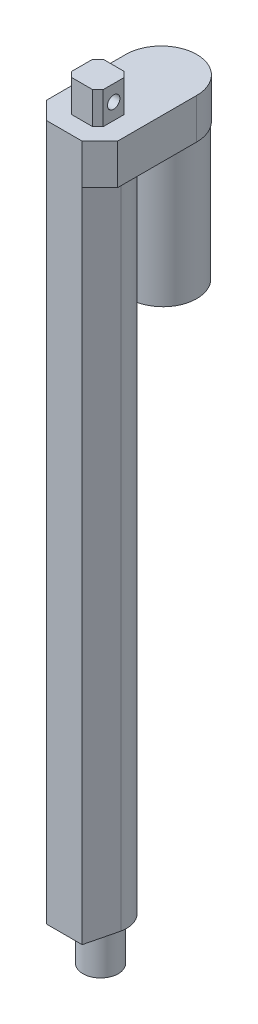
ISO-10303-21;
HEADER;
FILE_DESCRIPTION(('STEP AP214'),'2;1');
FILE_NAME('part.step','',(''),(''),'','','');
FILE_SCHEMA(('AUTOMOTIVE_DESIGN { 1 0 10303 214 1 1 1 1 }'));
ENDSEC;
DATA;
#1=APPLICATION_CONTEXT('core data for automotive mechanical design processes');
#2=APPLICATION_PROTOCOL_DEFINITION('international standard','automotive_design',2000,#1);
#3=PRODUCT_CONTEXT('',#1,'mechanical');
#4=PRODUCT('Part','Part','',(#3));
#5=PRODUCT_RELATED_PRODUCT_CATEGORY('part','',(#4));
#6=PRODUCT_DEFINITION_FORMATION('','',#4);
#7=PRODUCT_DEFINITION_CONTEXT('part definition',#1,'design');
#8=PRODUCT_DEFINITION('design','',#6,#7);
#9=PRODUCT_DEFINITION_SHAPE('','',#8);
#10=(LENGTH_UNIT() NAMED_UNIT(*) SI_UNIT(.MILLI.,.METRE.));
#11=(NAMED_UNIT(*) PLANE_ANGLE_UNIT() SI_UNIT($,.RADIAN.));
#12=(NAMED_UNIT(*) SI_UNIT($,.STERADIAN.) SOLID_ANGLE_UNIT());
#13=UNCERTAINTY_MEASURE_WITH_UNIT(LENGTH_MEASURE(1.E-05),#10,'distance_accuracy_value','');
#14=(GEOMETRIC_REPRESENTATION_CONTEXT(3) GLOBAL_UNCERTAINTY_ASSIGNED_CONTEXT((#13)) GLOBAL_UNIT_ASSIGNED_CONTEXT((#10,
#11,#12)) REPRESENTATION_CONTEXT('',''));
#15=CARTESIAN_POINT('',(0.,0.,0.));
#16=DIRECTION('',(0.,0.,1.));
#17=DIRECTION('',(1.,0.,0.));
#18=AXIS2_PLACEMENT_3D('',#15,#16,#17);
#19=CARTESIAN_POINT('',(0.,392.303,-34.2075));
#20=DIRECTION('',(0.,-1.,0.));
#21=DIRECTION('',(0.,0.,-1.));
#22=AXIS2_PLACEMENT_3D('',#19,#20,#21);
#23=PLANE('',#22);
#24=DIRECTION('',(0.,0.,1.));
#25=VECTOR('',#24,1.);
#26=CARTESIAN_POINT('',(-20.,392.303,20.405));
#27=LINE('',#26,#25);
#28=CARTESIAN_POINT('',(-20.,392.303,-34.2075));
#29=VERTEX_POINT('',#28);
#30=CARTESIAN_POINT('',(-20.,392.303,10.405));
#31=VERTEX_POINT('',#30);
#32=EDGE_CURVE('E220',#29,#31,#27,.T.);
#33=ORIENTED_EDGE('',*,*,#32,.T.);
#34=DIRECTION('',(-0.707106781186548,0.,-0.707106781186547));
#35=VECTOR('',#34,1.);
#36=CARTESIAN_POINT('',(-9.99999999999999,392.303,20.405));
#37=LINE('',#36,#35);
#38=CARTESIAN_POINT('',(-9.99999999999999,392.303,20.405));
#39=VERTEX_POINT('',#38);
#40=EDGE_CURVE('E288',#31,#39,#37,.F.);
#41=ORIENTED_EDGE('',*,*,#40,.T.);
#42=DIRECTION('',(1.,0.,0.));
#43=VECTOR('',#42,1.);
#44=CARTESIAN_POINT('',(-20.,392.303,20.405));
#45=LINE('',#44,#43);
#46=CARTESIAN_POINT('',(9.99999999999999,392.303,20.405));
#47=VERTEX_POINT('',#46);
#48=EDGE_CURVE('E187',#39,#47,#45,.T.);
#49=ORIENTED_EDGE('',*,*,#48,.T.);
#50=DIRECTION('',(-0.707106781186548,0.,0.707106781186548));
#51=VECTOR('',#50,1.);
#52=CARTESIAN_POINT('',(20.,392.303,10.405));
#53=LINE('',#52,#51);
#54=CARTESIAN_POINT('',(20.,392.303,10.405));
#55=VERTEX_POINT('',#54);
#56=EDGE_CURVE('E182',#47,#55,#53,.F.);
#57=ORIENTED_EDGE('',*,*,#56,.T.);
#58=DIRECTION('',(0.,0.,-1.));
#59=VECTOR('',#58,1.);
#60=CARTESIAN_POINT('',(20.,392.303,20.405));
#61=LINE('',#60,#59);
#62=CARTESIAN_POINT('',(20.,392.303,-34.2075));
#63=VERTEX_POINT('',#62);
#64=EDGE_CURVE('E174',#55,#63,#61,.T.);
#65=ORIENTED_EDGE('',*,*,#64,.T.);
#66=CARTESIAN_POINT('',(0.,392.303,-34.2075));
#67=DIRECTION('',(0.,1.,0.));
#68=DIRECTION('',(0.,0.,-1.));
#69=AXIS2_PLACEMENT_3D('',#66,#67,#68);
#70=CIRCLE('',#69,20.);
#71=EDGE_CURVE('E178',#63,#29,#70,.T.);
#72=ORIENTED_EDGE('',*,*,#71,.T.);
#73=EDGE_LOOP('',(#33,#41,#49,#57,#65,#72));
#74=FACE_BOUND('',#73,.T.);
#75=DIRECTION('',(0.,0.,1.));
#76=VECTOR('',#75,1.);
#77=CARTESIAN_POINT('',(-8.89,392.303,10.405));
#78=LINE('',#77,#76);
#79=CARTESIAN_POINT('',(-8.89,392.303,-4.37499999999999));
#80=VERTEX_POINT('',#79);
#81=CARTESIAN_POINT('',(-8.89,392.303,7.405));
#82=VERTEX_POINT('',#81);
#83=EDGE_CURVE('E299',#80,#82,#78,.T.);
#84=ORIENTED_EDGE('',*,*,#83,.F.);
#85=DIRECTION('',(-0.707106781186547,0.,0.707106781186548));
#86=VECTOR('',#85,1.);
#87=CARTESIAN_POINT('',(10.47125,392.303,-23.73625));
#88=LINE('',#87,#86);
#89=CARTESIAN_POINT('',(-5.89,392.303,-7.37499999999999));
#90=VERTEX_POINT('',#89);
#91=EDGE_CURVE('E62',#80,#90,#88,.F.);
#92=ORIENTED_EDGE('',*,*,#91,.T.);
#93=DIRECTION('',(-1.,0.,0.));
#94=VECTOR('',#93,1.);
#95=CARTESIAN_POINT('',(-8.89,392.303,-7.37499999999999));
#96=LINE('',#95,#94);
#97=CARTESIAN_POINT('',(5.89000000000005,392.303,-7.37499999999999));
#98=VERTEX_POINT('',#97);
#99=EDGE_CURVE('E390',#98,#90,#96,.T.);
#100=ORIENTED_EDGE('',*,*,#99,.F.);
#101=DIRECTION('',(-0.707106781186548,0.,-0.707106781186548));
#102=VECTOR('',#101,1.);
#103=CARTESIAN_POINT('',(-10.47125,392.303,-23.73625));
#104=LINE('',#103,#102);
#105=CARTESIAN_POINT('',(8.89,392.303,-4.37500000000004));
#106=VERTEX_POINT('',#105);
#107=EDGE_CURVE('E11',#98,#106,#104,.F.);
#108=ORIENTED_EDGE('',*,*,#107,.T.);
#109=DIRECTION('',(0.,0.,-1.));
#110=VECTOR('',#109,1.);
#111=CARTESIAN_POINT('',(8.89,392.303,10.405));
#112=LINE('',#111,#110);
#113=CARTESIAN_POINT('',(8.89,392.303,7.405));
#114=VERTEX_POINT('',#113);
#115=EDGE_CURVE('E350',#114,#106,#112,.T.);
#116=ORIENTED_EDGE('',*,*,#115,.F.);
#117=DIRECTION('',(0.707106781186548,0.,-0.707106781186547));
#118=VECTOR('',#117,1.);
#119=CARTESIAN_POINT('',(25.25125,392.303,-8.95625));
#120=LINE('',#119,#118);
#121=CARTESIAN_POINT('',(5.88999999999999,392.303,10.405));
#122=VERTEX_POINT('',#121);
#123=EDGE_CURVE('E342',#114,#122,#120,.F.);
#124=ORIENTED_EDGE('',*,*,#123,.T.);
#125=DIRECTION('',(1.,0.,0.));
#126=VECTOR('',#125,1.);
#127=CARTESIAN_POINT('',(-8.89,392.303,10.405));
#128=LINE('',#127,#126);
#129=CARTESIAN_POINT('',(-5.89,392.303,10.405));
#130=VERTEX_POINT('',#129);
#131=EDGE_CURVE('E348',#130,#122,#128,.T.);
#132=ORIENTED_EDGE('',*,*,#131,.F.);
#133=DIRECTION('',(0.707106781186548,0.,0.707106781186548));
#134=VECTOR('',#133,1.);
#135=CARTESIAN_POINT('',(-25.25125,392.303,-8.95625000000001));
#136=LINE('',#135,#134);
#137=EDGE_CURVE('E339',#130,#82,#136,.F.);
#138=ORIENTED_EDGE('',*,*,#137,.T.);
#139=EDGE_LOOP('',(#84,#92,#100,#108,#116,#124,#132,#138));
#140=FACE_BOUND('',#139,.T.);
#141=ADVANCED_FACE('F52',(#74,#140),#23,.F.);
#142=CARTESIAN_POINT('',(0.,369.57,0.));
#143=DIRECTION('',(0.,-1.,0.));
#144=DIRECTION('',(0.,0.,-1.));
#145=AXIS2_PLACEMENT_3D('',#142,#143,#144);
#146=CYLINDRICAL_SURFACE('',#145,14.595);
#147=CARTESIAN_POINT('',(0.,0.,0.));
#148=DIRECTION('',(0.,1.,0.));
#149=DIRECTION('',(0.,0.,1.));
#150=AXIS2_PLACEMENT_3D('',#147,#148,#149);
#151=CIRCLE('',#150,14.595);
#152=CARTESIAN_POINT('',(14.2987228957516,0.,2.92584151151603));
#153=VERTEX_POINT('',#152);
#154=CARTESIAN_POINT('',(-14.2987228957516,0.,2.92584151151603));
#155=VERTEX_POINT('',#154);
#156=EDGE_CURVE('E225',#153,#155,#151,.T.);
#157=ORIENTED_EDGE('',*,*,#156,.T.);
#158=DIRECTION('',(0.,-1.,0.));
#159=VECTOR('',#158,1.);
#160=CARTESIAN_POINT('',(-14.2987228957516,369.57,2.92584151151603));
#161=LINE('',#160,#159);
#162=CARTESIAN_POINT('',(-14.2987228957516,369.57,2.92584151151603));
#163=VERTEX_POINT('',#162);
#164=EDGE_CURVE('E231',#163,#155,#161,.T.);
#165=ORIENTED_EDGE('',*,*,#164,.F.);
#166=CARTESIAN_POINT('',(0.,369.57,0.));
#167=DIRECTION('',(0.,1.,0.));
#168=DIRECTION('',(0.,0.,1.));
#169=AXIS2_PLACEMENT_3D('',#166,#167,#168);
#170=CIRCLE('',#169,14.595);
#171=CARTESIAN_POINT('',(14.2987228957516,369.57,2.92584151151603));
#172=VERTEX_POINT('',#171);
#173=EDGE_CURVE('E232',#172,#163,#170,.T.);
#174=ORIENTED_EDGE('',*,*,#173,.F.);
#175=DIRECTION('',(0.,-1.,0.));
#176=VECTOR('',#175,1.);
#177=CARTESIAN_POINT('',(14.2987228957516,369.57,2.92584151151603));
#178=LINE('',#177,#176);
#179=EDGE_CURVE('E245',#172,#153,#178,.T.);
#180=ORIENTED_EDGE('',*,*,#179,.T.);
#181=EDGE_LOOP('',(#157,#165,#174,#180));
#182=FACE_BOUND('',#181,.T.);
#183=ADVANCED_FACE('F434',(#182),#146,.T.);
#184=CARTESIAN_POINT('',(-10.,369.57,20.405));
#185=DIRECTION('',(0.971064360471332,0.,-0.238817938652864));
#186=DIRECTION('',(-0.238817938652864,0.,-0.971064360471332));
#187=AXIS2_PLACEMENT_3D('',#184,#185,#186);
#188=PLANE('',#187);
#189=DIRECTION('',(0.238817938652864,0.,0.971064360471332));
#190=VECTOR('',#189,1.);
#191=CARTESIAN_POINT('',(-10.,0.,20.405));
#192=LINE('',#191,#190);
#193=CARTESIAN_POINT('',(-10.,0.,20.405));
#194=VERTEX_POINT('',#193);
#195=EDGE_CURVE('E249',#155,#194,#192,.T.);
#196=ORIENTED_EDGE('',*,*,#195,.T.);
#197=DIRECTION('',(0.,-1.,0.));
#198=VECTOR('',#197,1.);
#199=CARTESIAN_POINT('',(-10.,369.57,20.405));
#200=LINE('',#199,#198);
#201=CARTESIAN_POINT('',(-10.,369.57,20.405));
#202=VERTEX_POINT('',#201);
#203=EDGE_CURVE('E264',#202,#194,#200,.T.);
#204=ORIENTED_EDGE('',*,*,#203,.F.);
#205=DIRECTION('',(0.238817938652864,0.,0.971064360471332));
#206=VECTOR('',#205,1.);
#207=CARTESIAN_POINT('',(-10.,369.57,20.405));
#208=LINE('',#207,#206);
#209=EDGE_CURVE('E236',#163,#202,#208,.T.);
#210=ORIENTED_EDGE('',*,*,#209,.F.);
#211=ORIENTED_EDGE('',*,*,#164,.T.);
#212=EDGE_LOOP('',(#196,#204,#210,#211));
#213=FACE_BOUND('',#212,.T.);
#214=ADVANCED_FACE('F423',(#213),#188,.F.);
#215=CARTESIAN_POINT('',(10.,369.57,20.405));
#216=DIRECTION('',(0.,0.,-1.));
#217=DIRECTION('',(-1.,0.,0.));
#218=AXIS2_PLACEMENT_3D('',#215,#216,#217);
#219=PLANE('',#218);
#220=ORIENTED_EDGE('',*,*,#48,.F.);
#221=DIRECTION('',(0.,-1.,0.));
#222=VECTOR('',#221,1.);
#223=CARTESIAN_POINT('',(-9.99999999999999,369.57,20.405));
#224=LINE('',#223,#222);
#225=EDGE_CURVE('E273',#39,#202,#224,.T.);
#226=ORIENTED_EDGE('',*,*,#225,.T.);
#227=ORIENTED_EDGE('',*,*,#203,.T.);
#228=DIRECTION('',(1.,0.,0.));
#229=VECTOR('',#228,1.);
#230=CARTESIAN_POINT('',(10.,0.,20.405));
#231=LINE('',#230,#229);
#232=CARTESIAN_POINT('',(10.,0.,20.405));
#233=VERTEX_POINT('',#232);
#234=EDGE_CURVE('E252',#194,#233,#231,.T.);
#235=ORIENTED_EDGE('',*,*,#234,.T.);
#236=DIRECTION('',(0.,-1.,0.));
#237=VECTOR('',#236,1.);
#238=CARTESIAN_POINT('',(10.,369.57,20.405));
#239=LINE('',#238,#237);
#240=CARTESIAN_POINT('',(10.,369.57,20.405));
#241=VERTEX_POINT('',#240);
#242=EDGE_CURVE('E260',#241,#233,#239,.T.);
#243=ORIENTED_EDGE('',*,*,#242,.F.);
#244=DIRECTION('',(0.,1.,0.));
#245=VECTOR('',#244,1.);
#246=CARTESIAN_POINT('',(9.99999999999999,369.57,20.405));
#247=LINE('',#246,#245);
#248=EDGE_CURVE('E230',#241,#47,#247,.T.);
#249=ORIENTED_EDGE('',*,*,#248,.T.);
#250=EDGE_LOOP('',(#220,#226,#227,#235,#243,#249));
#251=FACE_BOUND('',#250,.T.);
#252=ADVANCED_FACE('F420',(#251),#219,.F.);
#253=CARTESIAN_POINT('',(14.2987228957516,369.57,2.92584151151603));
#254=DIRECTION('',(-0.971064360471332,0.,-0.238817938652864));
#255=DIRECTION('',(-0.238817938652864,0.,0.971064360471332));
#256=AXIS2_PLACEMENT_3D('',#253,#254,#255);
#257=PLANE('',#256);
#258=DIRECTION('',(0.238817938652864,0.,-0.971064360471332));
#259=VECTOR('',#258,1.);
#260=CARTESIAN_POINT('',(14.2987228957516,0.,2.92584151151603));
#261=LINE('',#260,#259);
#262=EDGE_CURVE('E237',#233,#153,#261,.T.);
#263=ORIENTED_EDGE('',*,*,#262,.T.);
#264=ORIENTED_EDGE('',*,*,#179,.F.);
#265=DIRECTION('',(0.238817938652864,0.,-0.971064360471332));
#266=VECTOR('',#265,1.);
#267=CARTESIAN_POINT('',(14.2987228957516,369.57,2.92584151151603));
#268=LINE('',#267,#266);
#269=EDGE_CURVE('E241',#241,#172,#268,.T.);
#270=ORIENTED_EDGE('',*,*,#269,.F.);
#271=ORIENTED_EDGE('',*,*,#242,.T.);
#272=EDGE_LOOP('',(#263,#264,#270,#271));
#273=FACE_BOUND('',#272,.T.);
#274=ADVANCED_FACE('F431',(#273),#257,.F.);
#275=CARTESIAN_POINT('',(0.,0.,0.));
#276=DIRECTION('',(0.,1.,0.));
#277=DIRECTION('',(0.,0.,1.));
#278=AXIS2_PLACEMENT_3D('',#275,#276,#277);
#279=PLANE('',#278);
#280=CARTESIAN_POINT('',(0.,0.,0.));
#281=DIRECTION('',(0.,-1.,0.));
#282=DIRECTION('',(0.,0.,-1.));
#283=AXIS2_PLACEMENT_3D('',#280,#281,#282);
#284=CIRCLE('',#283,9.975);
#285=CARTESIAN_POINT('',(0.,0.,-9.975));
#286=VERTEX_POINT('',#285);
#287=EDGE_CURVE('E226',#286,#286,#284,.T.);
#288=ORIENTED_EDGE('',*,*,#287,.F.);
#289=EDGE_LOOP('',(#288));
#290=FACE_BOUND('',#289,.T.);
#291=ORIENTED_EDGE('',*,*,#156,.F.);
#292=ORIENTED_EDGE('',*,*,#262,.F.);
#293=ORIENTED_EDGE('',*,*,#234,.F.);
#294=ORIENTED_EDGE('',*,*,#195,.F.);
#295=EDGE_LOOP('',(#291,#292,#293,#294));
#296=FACE_BOUND('',#295,.T.);
#297=ADVANCED_FACE('F427',(#290,#296),#279,.F.);
#298=CARTESIAN_POINT('',(0.,-24.4221,0.));
#299=DIRECTION('',(0.,1.,0.));
#300=DIRECTION('',(0.,0.,1.));
#301=AXIS2_PLACEMENT_3D('',#298,#299,#300);
#302=CYLINDRICAL_SURFACE('',#301,9.975);
#303=CARTESIAN_POINT('',(0.,-24.4221,0.));
#304=DIRECTION('',(0.,-1.,0.));
#305=DIRECTION('',(0.,0.,-1.));
#306=AXIS2_PLACEMENT_3D('',#303,#304,#305);
#307=CIRCLE('',#306,9.975);
#308=CARTESIAN_POINT('',(0.,-24.4221,-9.975));
#309=VERTEX_POINT('',#308);
#310=EDGE_CURVE('E198',#309,#309,#307,.T.);
#311=ORIENTED_EDGE('',*,*,#310,.F.);
#312=EDGE_LOOP('',(#311));
#313=FACE_BOUND('',#312,.T.);
#314=ORIENTED_EDGE('',*,*,#287,.T.);
#315=EDGE_LOOP('',(#314));
#316=FACE_BOUND('',#315,.T.);
#317=ADVANCED_FACE('F521',(#313,#316),#302,.T.);
#318=CARTESIAN_POINT('',(0.,-24.4221,0.));
#319=DIRECTION('',(0.,-1.,0.));
#320=DIRECTION('',(0.,0.,-1.));
#321=AXIS2_PLACEMENT_3D('',#318,#319,#320);
#322=PLANE('',#321);
#323=ORIENTED_EDGE('',*,*,#310,.T.);
#324=EDGE_LOOP('',(#323));
#325=FACE_BOUND('',#324,.T.);
#326=ADVANCED_FACE('F518',(#325),#322,.T.);
#327=CARTESIAN_POINT('',(-20.,392.303,20.405));
#328=DIRECTION('',(1.,0.,0.));
#329=DIRECTION('',(0.,0.,-1.));
#330=AXIS2_PLACEMENT_3D('',#327,#328,#329);
#331=PLANE('',#330);
#332=DIRECTION('',(0.,0.,1.));
#333=VECTOR('',#332,1.);
#334=CARTESIAN_POINT('',(-20.,369.57,20.405));
#335=LINE('',#334,#333);
#336=CARTESIAN_POINT('',(-20.,369.57,-34.2075));
#337=VERTEX_POINT('',#336);
#338=CARTESIAN_POINT('',(-20.,369.57,10.405));
#339=VERTEX_POINT('',#338);
#340=EDGE_CURVE('E210',#337,#339,#335,.T.);
#341=ORIENTED_EDGE('',*,*,#340,.T.);
#342=DIRECTION('',(0.,1.,0.));
#343=VECTOR('',#342,1.);
#344=CARTESIAN_POINT('',(-20.,392.303,10.405));
#345=LINE('',#344,#343);
#346=EDGE_CURVE('E283',#339,#31,#345,.T.);
#347=ORIENTED_EDGE('',*,*,#346,.T.);
#348=ORIENTED_EDGE('',*,*,#32,.F.);
#349=DIRECTION('',(0.,-1.,0.));
#350=VECTOR('',#349,1.);
#351=CARTESIAN_POINT('',(-20.,392.303,-34.2075));
#352=LINE('',#351,#350);
#353=EDGE_CURVE('E199',#29,#337,#352,.T.);
#354=ORIENTED_EDGE('',*,*,#353,.T.);
#355=EDGE_LOOP('',(#341,#347,#348,#354));
#356=FACE_BOUND('',#355,.T.);
#357=ADVANCED_FACE('F415',(#356),#331,.F.);
#358=CARTESIAN_POINT('',(20.,392.303,20.405));
#359=DIRECTION('',(-1.,0.,0.));
#360=DIRECTION('',(0.,0.,1.));
#361=AXIS2_PLACEMENT_3D('',#358,#359,#360);
#362=PLANE('',#361);
#363=ORIENTED_EDGE('',*,*,#64,.F.);
#364=DIRECTION('',(0.,-1.,0.));
#365=VECTOR('',#364,1.);
#366=CARTESIAN_POINT('',(20.,392.303,10.405));
#367=LINE('',#366,#365);
#368=CARTESIAN_POINT('',(20.,369.57,10.405));
#369=VERTEX_POINT('',#368);
#370=EDGE_CURVE('E291',#55,#369,#367,.T.);
#371=ORIENTED_EDGE('',*,*,#370,.T.);
#372=DIRECTION('',(0.,0.,-1.));
#373=VECTOR('',#372,1.);
#374=CARTESIAN_POINT('',(20.,369.57,20.405));
#375=LINE('',#374,#373);
#376=CARTESIAN_POINT('',(20.,369.57,-34.2075));
#377=VERTEX_POINT('',#376);
#378=EDGE_CURVE('E193',#369,#377,#375,.T.);
#379=ORIENTED_EDGE('',*,*,#378,.T.);
#380=DIRECTION('',(0.,-1.,0.));
#381=VECTOR('',#380,1.);
#382=CARTESIAN_POINT('',(20.,392.303,-34.2075));
#383=LINE('',#382,#381);
#384=EDGE_CURVE('E190',#63,#377,#383,.T.);
#385=ORIENTED_EDGE('',*,*,#384,.F.);
#386=EDGE_LOOP('',(#363,#371,#379,#385));
#387=FACE_BOUND('',#386,.T.);
#388=ADVANCED_FACE('F191',(#387),#362,.F.);
#389=CARTESIAN_POINT('',(0.,392.303,-34.2075));
#390=DIRECTION('',(0.,-1.,0.));
#391=DIRECTION('',(0.,0.,-1.));
#392=AXIS2_PLACEMENT_3D('',#389,#390,#391);
#393=CYLINDRICAL_SURFACE('',#392,20.);
#394=CARTESIAN_POINT('',(0.,369.57,-34.2075));
#395=DIRECTION('',(0.,1.,0.));
#396=DIRECTION('',(0.,0.,-1.));
#397=AXIS2_PLACEMENT_3D('',#394,#395,#396);
#398=CIRCLE('',#397,20.);
#399=CARTESIAN_POINT('',(0.,369.57,-54.2075));
#400=VERTEX_POINT('',#399);
#401=EDGE_CURVE('E218',#377,#400,#398,.T.);
#402=ORIENTED_EDGE('',*,*,#401,.T.);
#403=EDGE_CURVE('E217',#400,#337,#398,.T.);
#404=ORIENTED_EDGE('',*,*,#403,.T.);
#405=ORIENTED_EDGE('',*,*,#353,.F.);
#406=ORIENTED_EDGE('',*,*,#71,.F.);
#407=ORIENTED_EDGE('',*,*,#384,.T.);
#408=EDGE_LOOP('',(#402,#404,#405,#406,#407));
#409=FACE_BOUND('',#408,.T.);
#410=ADVANCED_FACE('F201',(#409),#393,.T.);
#411=CARTESIAN_POINT('',(0.,369.57,-34.2075));
#412=DIRECTION('',(0.,-1.,0.));
#413=DIRECTION('',(0.,0.,-1.));
#414=AXIS2_PLACEMENT_3D('',#411,#412,#413);
#415=PLANE('',#414);
#416=ORIENTED_EDGE('',*,*,#209,.T.);
#417=DIRECTION('',(0.707106781186548,0.,0.707106781186547));
#418=VECTOR('',#417,1.);
#419=CARTESIAN_POINT('',(-32.30625,369.57,-1.90125));
#420=LINE('',#419,#418);
#421=EDGE_CURVE('E280',#202,#339,#420,.F.);
#422=ORIENTED_EDGE('',*,*,#421,.T.);
#423=ORIENTED_EDGE('',*,*,#340,.F.);
#424=ORIENTED_EDGE('',*,*,#403,.F.);
#425=CARTESIAN_POINT('',(0.,369.57,-35.1575));
#426=DIRECTION('',(0.,-1.,0.));
#427=DIRECTION('',(0.,0.,-1.));
#428=AXIS2_PLACEMENT_3D('',#425,#426,#427);
#429=CIRCLE('',#428,19.05);
#430=EDGE_CURVE('E379',#400,#400,#429,.T.);
#431=ORIENTED_EDGE('',*,*,#430,.F.);
#432=ORIENTED_EDGE('',*,*,#401,.F.);
#433=ORIENTED_EDGE('',*,*,#378,.F.);
#434=DIRECTION('',(0.707106781186548,0.,-0.707106781186548));
#435=VECTOR('',#434,1.);
#436=CARTESIAN_POINT('',(32.30625,369.57,-1.90125));
#437=LINE('',#436,#435);
#438=EDGE_CURVE('E277',#369,#241,#437,.F.);
#439=ORIENTED_EDGE('',*,*,#438,.T.);
#440=ORIENTED_EDGE('',*,*,#269,.T.);
#441=ORIENTED_EDGE('',*,*,#173,.T.);
#442=EDGE_LOOP('',(#416,#422,#423,#424,#431,#432,#433,#439,#440,#441));
#443=FACE_BOUND('',#442,.T.);
#444=ADVANCED_FACE('F408',(#443),#415,.T.);
#445=CARTESIAN_POINT('',(0.,292.1,-35.1575));
#446=DIRECTION('',(0.,1.,0.));
#447=DIRECTION('',(0.,0.,1.));
#448=AXIS2_PLACEMENT_3D('',#445,#446,#447);
#449=CYLINDRICAL_SURFACE('',#448,19.05);
#450=CARTESIAN_POINT('',(0.,292.1,-35.1575));
#451=DIRECTION('',(0.,-1.,0.));
#452=DIRECTION('',(0.,0.,-1.));
#453=AXIS2_PLACEMENT_3D('',#450,#451,#452);
#454=CIRCLE('',#453,19.05);
#455=CARTESIAN_POINT('',(0.,292.1,-54.2075));
#456=VERTEX_POINT('',#455);
#457=EDGE_CURVE('E214',#456,#456,#454,.T.);
#458=ORIENTED_EDGE('',*,*,#457,.F.);
#459=EDGE_LOOP('',(#458));
#460=FACE_BOUND('',#459,.T.);
#461=ORIENTED_EDGE('',*,*,#430,.T.);
#462=EDGE_LOOP('',(#461));
#463=FACE_BOUND('',#462,.T.);
#464=ADVANCED_FACE('F506',(#460,#463),#449,.T.);
#465=CARTESIAN_POINT('',(0.,292.1,-35.1575));
#466=DIRECTION('',(0.,-1.,0.));
#467=DIRECTION('',(0.,0.,-1.));
#468=AXIS2_PLACEMENT_3D('',#465,#466,#467);
#469=PLANE('',#468);
#470=ORIENTED_EDGE('',*,*,#457,.T.);
#471=EDGE_LOOP('',(#470));
#472=FACE_BOUND('',#471,.T.);
#473=ADVANCED_FACE('F453',(#472),#469,.T.);
#474=CARTESIAN_POINT('',(-9.99999999999999,369.57,20.405));
#475=DIRECTION('',(0.707106781186547,0.,-0.707106781186548));
#476=DIRECTION('',(0.,-1.,0.));
#477=AXIS2_PLACEMENT_3D('',#474,#475,#476);
#478=PLANE('',#477);
#479=ORIENTED_EDGE('',*,*,#40,.F.);
#480=ORIENTED_EDGE('',*,*,#346,.F.);
#481=ORIENTED_EDGE('',*,*,#421,.F.);
#482=ORIENTED_EDGE('',*,*,#225,.F.);
#483=EDGE_LOOP('',(#479,#480,#481,#482));
#484=FACE_BOUND('',#483,.T.);
#485=ADVANCED_FACE('F418',(#484),#478,.F.);
#486=CARTESIAN_POINT('',(20.,392.303,10.405));
#487=DIRECTION('',(-0.707106781186547,0.,-0.707106781186547));
#488=DIRECTION('',(0.,-1.,0.));
#489=AXIS2_PLACEMENT_3D('',#486,#487,#488);
#490=PLANE('',#489);
#491=ORIENTED_EDGE('',*,*,#56,.F.);
#492=ORIENTED_EDGE('',*,*,#248,.F.);
#493=ORIENTED_EDGE('',*,*,#438,.F.);
#494=ORIENTED_EDGE('',*,*,#370,.F.);
#495=EDGE_LOOP('',(#491,#492,#493,#494));
#496=FACE_BOUND('',#495,.T.);
#497=ADVANCED_FACE('F406',(#496),#490,.F.);
#498=CARTESIAN_POINT('',(-8.89,410.403,10.405));
#499=DIRECTION('',(1.,0.,0.));
#500=DIRECTION('',(0.,0.,-1.));
#501=AXIS2_PLACEMENT_3D('',#498,#499,#500);
#502=PLANE('',#501);
#503=CARTESIAN_POINT('',(-8.89,401.353,1.51500000000001));
#504=DIRECTION('',(-1.,0.,0.));
#505=DIRECTION('',(0.,0.,1.));
#506=AXIS2_PLACEMENT_3D('',#503,#504,#505);
#507=CIRCLE('',#506,3.5);
#508=CARTESIAN_POINT('',(-8.89,401.353,5.01500000000001));
#509=VERTEX_POINT('',#508);
#510=EDGE_CURVE('E300',#509,#509,#507,.T.);
#511=ORIENTED_EDGE('',*,*,#510,.F.);
#512=EDGE_LOOP('',(#511));
#513=FACE_BOUND('',#512,.T.);
#514=ORIENTED_EDGE('',*,*,#83,.T.);
#515=DIRECTION('',(0.,1.,0.));
#516=VECTOR('',#515,1.);
#517=CARTESIAN_POINT('',(-8.89,410.403,7.405));
#518=LINE('',#517,#516);
#519=CARTESIAN_POINT('',(-8.89,410.403,7.405));
#520=VERTEX_POINT('',#519);
#521=EDGE_CURVE('E311',#82,#520,#518,.T.);
#522=ORIENTED_EDGE('',*,*,#521,.T.);
#523=DIRECTION('',(0.,0.,1.));
#524=VECTOR('',#523,1.);
#525=CARTESIAN_POINT('',(-8.89,410.403,10.405));
#526=LINE('',#525,#524);
#527=CARTESIAN_POINT('',(-8.89,410.403,-4.37499999999999));
#528=VERTEX_POINT('',#527);
#529=EDGE_CURVE('E381',#528,#520,#526,.T.);
#530=ORIENTED_EDGE('',*,*,#529,.F.);
#531=DIRECTION('',(0.,-1.,0.));
#532=VECTOR('',#531,1.);
#533=CARTESIAN_POINT('',(-8.89,410.403,-4.37499999999999));
#534=LINE('',#533,#532);
#535=EDGE_CURVE('E307',#528,#80,#534,.T.);
#536=ORIENTED_EDGE('',*,*,#535,.T.);
#537=EDGE_LOOP('',(#514,#522,#530,#536));
#538=FACE_BOUND('',#537,.T.);
#539=ADVANCED_FACE('F459',(#513,#538),#502,.F.);
#540=CARTESIAN_POINT('',(-8.89,410.403,10.405));
#541=DIRECTION('',(0.,0.,-1.));
#542=DIRECTION('',(-1.,0.,0.));
#543=AXIS2_PLACEMENT_3D('',#540,#541,#542);
#544=PLANE('',#543);
#545=DIRECTION('',(1.,0.,0.));
#546=VECTOR('',#545,1.);
#547=CARTESIAN_POINT('',(-8.89,410.403,10.405));
#548=LINE('',#547,#546);
#549=CARTESIAN_POINT('',(-5.89,410.403,10.405));
#550=VERTEX_POINT('',#549);
#551=CARTESIAN_POINT('',(5.88999999999999,410.403,10.405));
#552=VERTEX_POINT('',#551);
#553=EDGE_CURVE('E370',#550,#552,#548,.T.);
#554=ORIENTED_EDGE('',*,*,#553,.F.);
#555=DIRECTION('',(0.,-1.,0.));
#556=VECTOR('',#555,1.);
#557=CARTESIAN_POINT('',(-5.89,410.403,10.405));
#558=LINE('',#557,#556);
#559=EDGE_CURVE('E303',#550,#130,#558,.T.);
#560=ORIENTED_EDGE('',*,*,#559,.T.);
#561=ORIENTED_EDGE('',*,*,#131,.T.);
#562=DIRECTION('',(0.,1.,0.));
#563=VECTOR('',#562,1.);
#564=CARTESIAN_POINT('',(5.88999999999999,410.403,10.405));
#565=LINE('',#564,#563);
#566=EDGE_CURVE('E294',#122,#552,#565,.T.);
#567=ORIENTED_EDGE('',*,*,#566,.T.);
#568=EDGE_LOOP('',(#554,#560,#561,#567));
#569=FACE_BOUND('',#568,.T.);
#570=ADVANCED_FACE('F356',(#569),#544,.F.);
#571=CARTESIAN_POINT('',(8.89,410.403,10.405));
#572=DIRECTION('',(-1.,0.,0.));
#573=DIRECTION('',(0.,0.,1.));
#574=AXIS2_PLACEMENT_3D('',#571,#572,#573);
#575=PLANE('',#574);
#576=CARTESIAN_POINT('',(8.89,401.353,1.51500000000001));
#577=DIRECTION('',(-1.,0.,0.));
#578=DIRECTION('',(0.,0.,1.));
#579=AXIS2_PLACEMENT_3D('',#576,#577,#578);
#580=CIRCLE('',#579,3.5);
#581=CARTESIAN_POINT('',(8.89,401.353,5.01500000000001));
#582=VERTEX_POINT('',#581);
#583=EDGE_CURVE('E295',#582,#582,#580,.T.);
#584=ORIENTED_EDGE('',*,*,#583,.T.);
#585=EDGE_LOOP('',(#584));
#586=FACE_BOUND('',#585,.T.);
#587=DIRECTION('',(0.,0.,-1.));
#588=VECTOR('',#587,1.);
#589=CARTESIAN_POINT('',(8.89,410.403,10.405));
#590=LINE('',#589,#588);
#591=CARTESIAN_POINT('',(8.89,410.403,7.405));
#592=VERTEX_POINT('',#591);
#593=CARTESIAN_POINT('',(8.89,410.403,-4.37500000000004));
#594=VERTEX_POINT('',#593);
#595=EDGE_CURVE('E368',#592,#594,#590,.T.);
#596=ORIENTED_EDGE('',*,*,#595,.F.);
#597=DIRECTION('',(0.,-1.,0.));
#598=VECTOR('',#597,1.);
#599=CARTESIAN_POINT('',(8.89,410.403,7.405));
#600=LINE('',#599,#598);
#601=EDGE_CURVE('E329',#592,#114,#600,.T.);
#602=ORIENTED_EDGE('',*,*,#601,.T.);
#603=ORIENTED_EDGE('',*,*,#115,.T.);
#604=DIRECTION('',(0.,1.,0.));
#605=VECTOR('',#604,1.);
#606=CARTESIAN_POINT('',(8.89,410.403,-4.37500000000004));
#607=LINE('',#606,#605);
#608=EDGE_CURVE('E326',#106,#594,#607,.T.);
#609=ORIENTED_EDGE('',*,*,#608,.T.);
#610=EDGE_LOOP('',(#596,#602,#603,#609));
#611=FACE_BOUND('',#610,.T.);
#612=ADVANCED_FACE('F372',(#586,#611),#575,.F.);
#613=CARTESIAN_POINT('',(-8.89,410.403,-7.37499999999999));
#614=DIRECTION('',(0.,0.,1.));
#615=DIRECTION('',(1.,0.,0.));
#616=AXIS2_PLACEMENT_3D('',#613,#614,#615);
#617=PLANE('',#616);
#618=ORIENTED_EDGE('',*,*,#99,.T.);
#619=DIRECTION('',(0.,1.,0.));
#620=VECTOR('',#619,1.);
#621=CARTESIAN_POINT('',(-5.89,410.403,-7.37499999999999));
#622=LINE('',#621,#620);
#623=CARTESIAN_POINT('',(-5.89,410.403,-7.37499999999999));
#624=VERTEX_POINT('',#623);
#625=EDGE_CURVE('E336',#90,#624,#622,.T.);
#626=ORIENTED_EDGE('',*,*,#625,.T.);
#627=DIRECTION('',(-1.,0.,0.));
#628=VECTOR('',#627,1.);
#629=CARTESIAN_POINT('',(-8.89,410.403,-7.37499999999999));
#630=LINE('',#629,#628);
#631=CARTESIAN_POINT('',(5.89000000000005,410.403,-7.37499999999999));
#632=VERTEX_POINT('',#631);
#633=EDGE_CURVE('E374',#632,#624,#630,.T.);
#634=ORIENTED_EDGE('',*,*,#633,.F.);
#635=DIRECTION('',(0.,-1.,0.));
#636=VECTOR('',#635,1.);
#637=CARTESIAN_POINT('',(5.89000000000005,410.403,-7.37499999999999));
#638=LINE('',#637,#636);
#639=EDGE_CURVE('E333',#632,#98,#638,.T.);
#640=ORIENTED_EDGE('',*,*,#639,.T.);
#641=EDGE_LOOP('',(#618,#626,#634,#640));
#642=FACE_BOUND('',#641,.T.);
#643=ADVANCED_FACE('F602',(#642),#617,.F.);
#644=CARTESIAN_POINT('',(0.,410.403,0.));
#645=DIRECTION('',(0.,-1.,0.));
#646=DIRECTION('',(0.,0.,-1.));
#647=AXIS2_PLACEMENT_3D('',#644,#645,#646);
#648=PLANE('',#647);
#649=ORIENTED_EDGE('',*,*,#529,.T.);
#650=DIRECTION('',(-0.707106781186548,0.,-0.707106781186548));
#651=VECTOR('',#650,1.);
#652=CARTESIAN_POINT('',(-5.89,410.403,10.405));
#653=LINE('',#652,#651);
#654=EDGE_CURVE('E323',#520,#550,#653,.F.);
#655=ORIENTED_EDGE('',*,*,#654,.T.);
#656=ORIENTED_EDGE('',*,*,#553,.T.);
#657=DIRECTION('',(-0.707106781186548,0.,0.707106781186547));
#658=VECTOR('',#657,1.);
#659=CARTESIAN_POINT('',(8.89,410.403,7.405));
#660=LINE('',#659,#658);
#661=EDGE_CURVE('E320',#552,#592,#660,.F.);
#662=ORIENTED_EDGE('',*,*,#661,.T.);
#663=ORIENTED_EDGE('',*,*,#595,.T.);
#664=DIRECTION('',(0.707106781186548,0.,0.707106781186548));
#665=VECTOR('',#664,1.);
#666=CARTESIAN_POINT('',(5.89000000000005,410.403,-7.37499999999999));
#667=LINE('',#666,#665);
#668=EDGE_CURVE('E314',#594,#632,#667,.F.);
#669=ORIENTED_EDGE('',*,*,#668,.T.);
#670=ORIENTED_EDGE('',*,*,#633,.T.);
#671=DIRECTION('',(0.707106781186547,0.,-0.707106781186548));
#672=VECTOR('',#671,1.);
#673=CARTESIAN_POINT('',(-8.89,410.403,-4.37499999999999));
#674=LINE('',#673,#672);
#675=EDGE_CURVE('E317',#624,#528,#674,.F.);
#676=ORIENTED_EDGE('',*,*,#675,.T.);
#677=EDGE_LOOP('',(#649,#655,#656,#662,#663,#669,#670,#676));
#678=FACE_BOUND('',#677,.T.);
#679=ADVANCED_FACE('F367',(#678),#648,.F.);
#680=CARTESIAN_POINT('',(9.21,401.353,1.51500000000001));
#681=DIRECTION('',(-1.,0.,0.));
#682=DIRECTION('',(0.,0.,1.));
#683=AXIS2_PLACEMENT_3D('',#680,#681,#682);
#684=CYLINDRICAL_SURFACE('',#683,3.5);
#685=ORIENTED_EDGE('',*,*,#510,.T.);
#686=EDGE_LOOP('',(#685));
#687=FACE_BOUND('',#686,.T.);
#688=ORIENTED_EDGE('',*,*,#583,.F.);
#689=EDGE_LOOP('',(#688));
#690=FACE_BOUND('',#689,.T.);
#691=ADVANCED_FACE('F466',(#687,#690),#684,.F.);
#692=CARTESIAN_POINT('',(-5.89,410.403,10.405));
#693=DIRECTION('',(0.707106781186548,0.,-0.707106781186548));
#694=DIRECTION('',(0.,-1.,0.));
#695=AXIS2_PLACEMENT_3D('',#692,#693,#694);
#696=PLANE('',#695);
#697=ORIENTED_EDGE('',*,*,#654,.F.);
#698=ORIENTED_EDGE('',*,*,#521,.F.);
#699=ORIENTED_EDGE('',*,*,#137,.F.);
#700=ORIENTED_EDGE('',*,*,#559,.F.);
#701=EDGE_LOOP('',(#697,#698,#699,#700));
#702=FACE_BOUND('',#701,.T.);
#703=ADVANCED_FACE('F460',(#702),#696,.F.);
#704=CARTESIAN_POINT('',(8.89,410.403,7.405));
#705=DIRECTION('',(-0.707106781186547,0.,-0.707106781186548));
#706=DIRECTION('',(0.,-1.,0.));
#707=AXIS2_PLACEMENT_3D('',#704,#705,#706);
#708=PLANE('',#707);
#709=ORIENTED_EDGE('',*,*,#661,.F.);
#710=ORIENTED_EDGE('',*,*,#566,.F.);
#711=ORIENTED_EDGE('',*,*,#123,.F.);
#712=ORIENTED_EDGE('',*,*,#601,.F.);
#713=EDGE_LOOP('',(#709,#710,#711,#712));
#714=FACE_BOUND('',#713,.T.);
#715=ADVANCED_FACE('F362',(#714),#708,.F.);
#716=CARTESIAN_POINT('',(-8.89,410.403,-4.37499999999999));
#717=DIRECTION('',(0.707106781186548,0.,0.707106781186547));
#718=DIRECTION('',(0.,-1.,0.));
#719=AXIS2_PLACEMENT_3D('',#716,#717,#718);
#720=PLANE('',#719);
#721=ORIENTED_EDGE('',*,*,#675,.F.);
#722=ORIENTED_EDGE('',*,*,#625,.F.);
#723=ORIENTED_EDGE('',*,*,#91,.F.);
#724=ORIENTED_EDGE('',*,*,#535,.F.);
#725=EDGE_LOOP('',(#721,#722,#723,#724));
#726=FACE_BOUND('',#725,.T.);
#727=ADVANCED_FACE('F472',(#726),#720,.F.);
#728=CARTESIAN_POINT('',(5.89000000000005,410.403,-7.37499999999999));
#729=DIRECTION('',(-0.707106781186548,0.,0.707106781186548));
#730=DIRECTION('',(0.,-1.,0.));
#731=AXIS2_PLACEMENT_3D('',#728,#729,#730);
#732=PLANE('',#731);
#733=ORIENTED_EDGE('',*,*,#668,.F.);
#734=ORIENTED_EDGE('',*,*,#608,.F.);
#735=ORIENTED_EDGE('',*,*,#107,.F.);
#736=ORIENTED_EDGE('',*,*,#639,.F.);
#737=EDGE_LOOP('',(#733,#734,#735,#736));
#738=FACE_BOUND('',#737,.T.);
#739=ADVANCED_FACE('F55',(#738),#732,.F.);
#740=CLOSED_SHELL('',(#141,#183,#214,#252,#274,#297,#317,#326,#357,#388,#410,#444,#464,#473,
#485,#497,#539,#570,#612,#643,#679,#691,#703,#715,#727,#739));
#741=MANIFOLD_SOLID_BREP('B2',#740);
#742=ADVANCED_BREP_SHAPE_REPRESENTATION('',(#18,#741),#14);
#743=SHAPE_DEFINITION_REPRESENTATION(#9,#742);
ENDSEC;
END-ISO-10303-21;
